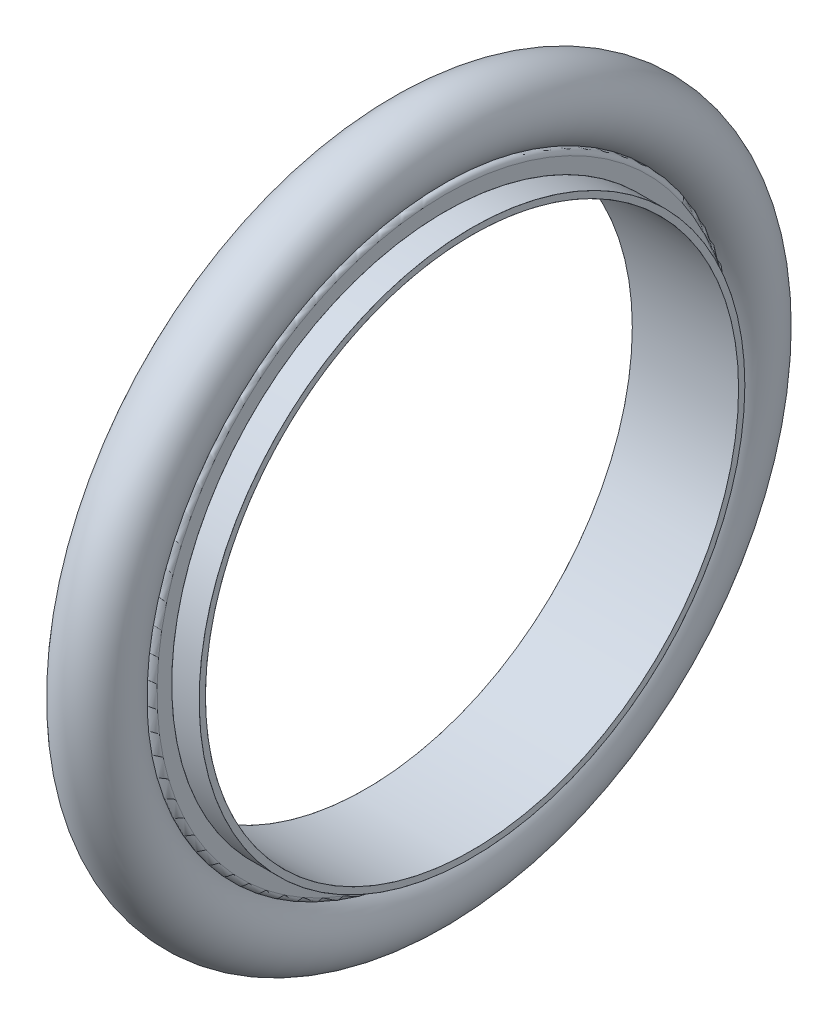
ISO-10303-21;
HEADER;
FILE_DESCRIPTION(('STEP AP214'),'2;1');
FILE_NAME('part.step','',(''),(''),'','','');
FILE_SCHEMA(('AUTOMOTIVE_DESIGN { 1 0 10303 214 1 1 1 1 }'));
ENDSEC;
DATA;
#1=APPLICATION_CONTEXT('core data for automotive mechanical design processes');
#2=APPLICATION_PROTOCOL_DEFINITION('international standard','automotive_design',2000,#1);
#3=PRODUCT_CONTEXT('',#1,'mechanical');
#4=PRODUCT('Part','Part','',(#3));
#5=PRODUCT_RELATED_PRODUCT_CATEGORY('part','',(#4));
#6=PRODUCT_DEFINITION_FORMATION('','',#4);
#7=PRODUCT_DEFINITION_CONTEXT('part definition',#1,'design');
#8=PRODUCT_DEFINITION('design','',#6,#7);
#9=PRODUCT_DEFINITION_SHAPE('','',#8);
#10=(LENGTH_UNIT() NAMED_UNIT(*) SI_UNIT(.MILLI.,.METRE.));
#11=(NAMED_UNIT(*) PLANE_ANGLE_UNIT() SI_UNIT($,.RADIAN.));
#12=(NAMED_UNIT(*) SI_UNIT($,.STERADIAN.) SOLID_ANGLE_UNIT());
#13=UNCERTAINTY_MEASURE_WITH_UNIT(LENGTH_MEASURE(1.E-05),#10,'distance_accuracy_value','');
#14=(GEOMETRIC_REPRESENTATION_CONTEXT(3) GLOBAL_UNCERTAINTY_ASSIGNED_CONTEXT((#13)) GLOBAL_UNIT_ASSIGNED_CONTEXT((#10,
#11,#12)) REPRESENTATION_CONTEXT('',''));
#15=CARTESIAN_POINT('',(0.,0.,0.));
#16=DIRECTION('',(0.,0.,1.));
#17=DIRECTION('',(1.,0.,0.));
#18=AXIS2_PLACEMENT_3D('',#15,#16,#17);
#19=CARTESIAN_POINT('',(-3.16217300000008,0.,0.));
#20=DIRECTION('',(1.,0.,0.));
#21=DIRECTION('',(0.,0.,-1.));
#22=AXIS2_PLACEMENT_3D('',#19,#20,#21);
#23=CYLINDRICAL_SURFACE('',#22,20.0025);
#24=CARTESIAN_POINT('',(-3.98754600000008,0.,0.));
#25=DIRECTION('',(1.,0.,0.));
#26=DIRECTION('',(0.,0.,-1.));
#27=AXIS2_PLACEMENT_3D('',#24,#25,#26);
#28=CIRCLE('',#27,20.0025);
#29=CARTESIAN_POINT('',(-3.98754600000008,0.,-20.0025));
#30=VERTEX_POINT('',#29);
#31=EDGE_CURVE('E241',#30,#30,#28,.T.);
#32=ORIENTED_EDGE('',*,*,#31,.F.);
#33=EDGE_LOOP('',(#32));
#34=FACE_BOUND('',#33,.T.);
#35=CARTESIAN_POINT('',(3.98754599999992,0.,0.));
#36=DIRECTION('',(1.,0.,0.));
#37=DIRECTION('',(0.,0.,-1.));
#38=AXIS2_PLACEMENT_3D('',#35,#36,#37);
#39=CIRCLE('',#38,20.0025);
#40=CARTESIAN_POINT('',(3.98754599999992,0.,-20.0025));
#41=VERTEX_POINT('',#40);
#42=EDGE_CURVE('E237',#41,#41,#39,.F.);
#43=ORIENTED_EDGE('',*,*,#42,.F.);
#44=EDGE_LOOP('',(#43));
#45=FACE_BOUND('',#44,.T.);
#46=ADVANCED_FACE('F17',(#34,#45),#23,.F.);
#47=CARTESIAN_POINT('',(-3.98754600000008,0.,0.));
#48=DIRECTION('',(1.,0.,0.));
#49=DIRECTION('',(0.,0.,-1.));
#50=AXIS2_PLACEMENT_3D('',#47,#48,#49);
#51=TOROIDAL_SURFACE('',#50,20.002754,0.000254);
#52=ORIENTED_EDGE('',*,*,#31,.T.);
#53=EDGE_LOOP('',(#52));
#54=FACE_BOUND('',#53,.T.);
#55=CARTESIAN_POINT('',(-3.98780000000008,0.,0.));
#56=DIRECTION('',(-1.,0.,0.));
#57=DIRECTION('',(0.,1.,0.));
#58=AXIS2_PLACEMENT_3D('',#55,#56,#57);
#59=CIRCLE('',#58,20.002754);
#60=CARTESIAN_POINT('',(-3.98780000000008,20.002754,0.));
#61=VERTEX_POINT('',#60);
#62=EDGE_CURVE('E240',#61,#61,#59,.F.);
#63=ORIENTED_EDGE('',*,*,#62,.F.);
#64=EDGE_LOOP('',(#63));
#65=FACE_BOUND('',#64,.T.);
#66=ADVANCED_FACE('F260',(#54,#65),#51,.T.);
#67=CARTESIAN_POINT('',(3.98754599999992,0.,0.));
#68=DIRECTION('',(1.,0.,0.));
#69=DIRECTION('',(0.,0.,-1.));
#70=AXIS2_PLACEMENT_3D('',#67,#68,#69);
#71=TOROIDAL_SURFACE('',#70,20.002754,0.000254);
#72=CARTESIAN_POINT('',(3.98779999999992,0.,0.));
#73=DIRECTION('',(1.,0.,0.));
#74=DIRECTION('',(0.,1.,0.));
#75=AXIS2_PLACEMENT_3D('',#72,#73,#74);
#76=CIRCLE('',#75,20.002754);
#77=CARTESIAN_POINT('',(3.98779999999992,20.002754,0.));
#78=VERTEX_POINT('',#77);
#79=EDGE_CURVE('E248',#78,#78,#76,.F.);
#80=ORIENTED_EDGE('',*,*,#79,.F.);
#81=EDGE_LOOP('',(#80));
#82=FACE_BOUND('',#81,.T.);
#83=ORIENTED_EDGE('',*,*,#42,.T.);
#84=EDGE_LOOP('',(#83));
#85=FACE_BOUND('',#84,.T.);
#86=ADVANCED_FACE('F212',(#82,#85),#71,.T.);
#87=CARTESIAN_POINT('',(-3.98780000000008,20.23745,0.));
#88=DIRECTION('',(-1.,0.,0.));
#89=DIRECTION('',(0.,0.,1.));
#90=AXIS2_PLACEMENT_3D('',#87,#88,#89);
#91=PLANE('',#90);
#92=ORIENTED_EDGE('',*,*,#62,.T.);
#93=EDGE_LOOP('',(#92));
#94=FACE_BOUND('',#93,.T.);
#95=CARTESIAN_POINT('',(-3.98780000000008,0.,0.));
#96=DIRECTION('',(1.,0.,0.));
#97=DIRECTION('',(0.,1.,0.));
#98=AXIS2_PLACEMENT_3D('',#95,#96,#97);
#99=CIRCLE('',#98,20.472146);
#100=CARTESIAN_POINT('',(-3.98780000000008,20.472146,0.));
#101=VERTEX_POINT('',#100);
#102=EDGE_CURVE('E195',#101,#101,#99,.T.);
#103=ORIENTED_EDGE('',*,*,#102,.F.);
#104=EDGE_LOOP('',(#103));
#105=FACE_BOUND('',#104,.T.);
#106=ADVANCED_FACE('F202',(#94,#105),#91,.T.);
#107=CARTESIAN_POINT('',(3.98779999999992,20.23745,0.));
#108=DIRECTION('',(1.,0.,0.));
#109=DIRECTION('',(0.,0.,-1.));
#110=AXIS2_PLACEMENT_3D('',#107,#108,#109);
#111=PLANE('',#110);
#112=ORIENTED_EDGE('',*,*,#79,.T.);
#113=EDGE_LOOP('',(#112));
#114=FACE_BOUND('',#113,.T.);
#115=CARTESIAN_POINT('',(3.98779999999992,0.,0.));
#116=DIRECTION('',(-1.,0.,0.));
#117=DIRECTION('',(0.,1.,0.));
#118=AXIS2_PLACEMENT_3D('',#115,#116,#117);
#119=CIRCLE('',#118,20.472146);
#120=CARTESIAN_POINT('',(3.98779999999992,20.472146,0.));
#121=VERTEX_POINT('',#120);
#122=EDGE_CURVE('E162',#121,#121,#119,.T.);
#123=ORIENTED_EDGE('',*,*,#122,.F.);
#124=EDGE_LOOP('',(#123));
#125=FACE_BOUND('',#124,.T.);
#126=ADVANCED_FACE('F211',(#114,#125),#111,.T.);
#127=CARTESIAN_POINT('',(-3.98754600000008,0.,0.));
#128=DIRECTION('',(1.,0.,0.));
#129=DIRECTION('',(0.,0.,-1.));
#130=AXIS2_PLACEMENT_3D('',#127,#128,#129);
#131=TOROIDAL_SURFACE('',#130,20.472146,0.000254);
#132=ORIENTED_EDGE('',*,*,#102,.T.);
#133=EDGE_LOOP('',(#132));
#134=FACE_BOUND('',#133,.T.);
#135=CARTESIAN_POINT('',(-3.98754600000008,0.,0.));
#136=DIRECTION('',(1.,0.,0.));
#137=DIRECTION('',(0.,0.,-1.));
#138=AXIS2_PLACEMENT_3D('',#135,#136,#137);
#139=CIRCLE('',#138,20.4724);
#140=CARTESIAN_POINT('',(-3.98754600000008,0.,-20.4724));
#141=VERTEX_POINT('',#140);
#142=EDGE_CURVE('E157',#141,#141,#139,.T.);
#143=ORIENTED_EDGE('',*,*,#142,.F.);
#144=EDGE_LOOP('',(#143));
#145=FACE_BOUND('',#144,.T.);
#146=ADVANCED_FACE('F175',(#134,#145),#131,.T.);
#147=CARTESIAN_POINT('',(3.98754599999992,0.,0.));
#148=DIRECTION('',(1.,0.,0.));
#149=DIRECTION('',(0.,0.,-1.));
#150=AXIS2_PLACEMENT_3D('',#147,#148,#149);
#151=TOROIDAL_SURFACE('',#150,20.472146,0.000254);
#152=CARTESIAN_POINT('',(3.98754599999992,0.,0.));
#153=DIRECTION('',(1.,0.,0.));
#154=DIRECTION('',(0.,0.,-1.));
#155=AXIS2_PLACEMENT_3D('',#152,#153,#154);
#156=CIRCLE('',#155,20.4724);
#157=CARTESIAN_POINT('',(3.98754599999992,0.,-20.4724));
#158=VERTEX_POINT('',#157);
#159=EDGE_CURVE('E149',#158,#158,#156,.F.);
#160=ORIENTED_EDGE('',*,*,#159,.F.);
#161=EDGE_LOOP('',(#160));
#162=FACE_BOUND('',#161,.T.);
#163=ORIENTED_EDGE('',*,*,#122,.T.);
#164=EDGE_LOOP('',(#163));
#165=FACE_BOUND('',#164,.T.);
#166=ADVANCED_FACE('F170',(#162,#165),#151,.T.);
#167=CARTESIAN_POINT('',(-2.95910000000008,0.,0.));
#168=DIRECTION('',(1.,0.,0.));
#169=DIRECTION('',(0.,0.,-1.));
#170=AXIS2_PLACEMENT_3D('',#167,#168,#169);
#171=CYLINDRICAL_SURFACE('',#170,20.4724);
#172=ORIENTED_EDGE('',*,*,#142,.T.);
#173=EDGE_LOOP('',(#172));
#174=FACE_BOUND('',#173,.T.);
#175=CARTESIAN_POINT('',(-1.93065400000008,0.,0.));
#176=DIRECTION('',(1.,0.,0.));
#177=DIRECTION('',(0.,0.,-1.));
#178=AXIS2_PLACEMENT_3D('',#175,#176,#177);
#179=CIRCLE('',#178,20.4724);
#180=CARTESIAN_POINT('',(-1.93065400000008,0.,-20.4724));
#181=VERTEX_POINT('',#180);
#182=EDGE_CURVE('E117',#181,#181,#179,.F.);
#183=ORIENTED_EDGE('',*,*,#182,.T.);
#184=EDGE_LOOP('',(#183));
#185=FACE_BOUND('',#184,.T.);
#186=ADVANCED_FACE('F174',(#174,#185),#171,.T.);
#187=CARTESIAN_POINT('',(2.95909999999992,0.,0.));
#188=DIRECTION('',(1.,0.,0.));
#189=DIRECTION('',(0.,0.,-1.));
#190=AXIS2_PLACEMENT_3D('',#187,#188,#189);
#191=CYLINDRICAL_SURFACE('',#190,20.4724);
#192=CARTESIAN_POINT('',(1.93065399999992,0.,0.));
#193=DIRECTION('',(1.,0.,0.));
#194=DIRECTION('',(0.,0.,-1.));
#195=AXIS2_PLACEMENT_3D('',#192,#193,#194);
#196=CIRCLE('',#195,20.4724);
#197=CARTESIAN_POINT('',(1.93065399999992,0.,-20.4724));
#198=VERTEX_POINT('',#197);
#199=EDGE_CURVE('E113',#198,#198,#196,.T.);
#200=ORIENTED_EDGE('',*,*,#199,.T.);
#201=EDGE_LOOP('',(#200));
#202=FACE_BOUND('',#201,.T.);
#203=ORIENTED_EDGE('',*,*,#159,.T.);
#204=EDGE_LOOP('',(#203));
#205=FACE_BOUND('',#204,.T.);
#206=ADVANCED_FACE('F140',(#202,#205),#191,.T.);
#207=CARTESIAN_POINT('',(-1.93065400000008,0.,0.));
#208=DIRECTION('',(1.,0.,0.));
#209=DIRECTION('',(0.,0.,-1.));
#210=AXIS2_PLACEMENT_3D('',#207,#208,#209);
#211=TOROIDAL_SURFACE('',#210,20.472654,0.000254);
#212=ORIENTED_EDGE('',*,*,#182,.F.);
#213=EDGE_LOOP('',(#212));
#214=FACE_BOUND('',#213,.T.);
#215=CARTESIAN_POINT('',(-1.93040000000008,0.,0.));
#216=DIRECTION('',(-1.,0.,0.));
#217=DIRECTION('',(0.,1.,0.));
#218=AXIS2_PLACEMENT_3D('',#215,#216,#217);
#219=CIRCLE('',#218,20.472654);
#220=CARTESIAN_POINT('',(-1.93040000000008,20.472654,0.));
#221=VERTEX_POINT('',#220);
#222=EDGE_CURVE('E116',#221,#221,#219,.F.);
#223=ORIENTED_EDGE('',*,*,#222,.F.);
#224=EDGE_LOOP('',(#223));
#225=FACE_BOUND('',#224,.T.);
#226=ADVANCED_FACE('F136',(#214,#225),#211,.F.);
#227=CARTESIAN_POINT('',(1.93065399999992,0.,0.));
#228=DIRECTION('',(1.,0.,0.));
#229=DIRECTION('',(0.,0.,-1.));
#230=AXIS2_PLACEMENT_3D('',#227,#228,#229);
#231=TOROIDAL_SURFACE('',#230,20.472654,0.000254);
#232=CARTESIAN_POINT('',(1.93039999999992,0.,0.));
#233=DIRECTION('',(1.,0.,0.));
#234=DIRECTION('',(0.,1.,0.));
#235=AXIS2_PLACEMENT_3D('',#232,#233,#234);
#236=CIRCLE('',#235,20.472654);
#237=CARTESIAN_POINT('',(1.93039999999992,20.472654,0.));
#238=VERTEX_POINT('',#237);
#239=EDGE_CURVE('E124',#238,#238,#236,.F.);
#240=ORIENTED_EDGE('',*,*,#239,.F.);
#241=EDGE_LOOP('',(#240));
#242=FACE_BOUND('',#241,.T.);
#243=ORIENTED_EDGE('',*,*,#199,.F.);
#244=EDGE_LOOP('',(#243));
#245=FACE_BOUND('',#244,.T.);
#246=ADVANCED_FACE('F87',(#242,#245),#231,.F.);
#247=CARTESIAN_POINT('',(-1.93040000000008,21.0234406098197,0.));
#248=DIRECTION('',(-1.,0.,0.));
#249=DIRECTION('',(0.,0.,1.));
#250=AXIS2_PLACEMENT_3D('',#247,#248,#249);
#251=PLANE('',#250);
#252=ORIENTED_EDGE('',*,*,#222,.T.);
#253=EDGE_LOOP('',(#252));
#254=FACE_BOUND('',#253,.T.);
#255=CARTESIAN_POINT('',(-1.93040000000008,0.,0.));
#256=DIRECTION('',(1.,0.,0.));
#257=DIRECTION('',(0.,1.,0.));
#258=AXIS2_PLACEMENT_3D('',#255,#256,#257);
#259=CIRCLE('',#258,21.5742272196394);
#260=CARTESIAN_POINT('',(-1.93040000000008,21.5742272196394,0.));
#261=VERTEX_POINT('',#260);
#262=EDGE_CURVE('E70',#261,#261,#259,.T.);
#263=ORIENTED_EDGE('',*,*,#262,.F.);
#264=EDGE_LOOP('',(#263));
#265=FACE_BOUND('',#264,.T.);
#266=ADVANCED_FACE('F77',(#254,#265),#251,.T.);
#267=CARTESIAN_POINT('',(1.93039999999992,21.0234406098196,0.));
#268=DIRECTION('',(1.,0.,0.));
#269=DIRECTION('',(0.,0.,-1.));
#270=AXIS2_PLACEMENT_3D('',#267,#268,#269);
#271=PLANE('',#270);
#272=ORIENTED_EDGE('',*,*,#239,.T.);
#273=EDGE_LOOP('',(#272));
#274=FACE_BOUND('',#273,.T.);
#275=CARTESIAN_POINT('',(1.93039999999992,0.,0.));
#276=DIRECTION('',(-1.,0.,0.));
#277=DIRECTION('',(0.,1.,0.));
#278=AXIS2_PLACEMENT_3D('',#275,#276,#277);
#279=CIRCLE('',#278,21.5742272196393);
#280=CARTESIAN_POINT('',(1.93039999999992,21.5742272196393,0.));
#281=VERTEX_POINT('',#280);
#282=EDGE_CURVE('E30',#281,#281,#279,.T.);
#283=ORIENTED_EDGE('',*,*,#282,.F.);
#284=EDGE_LOOP('',(#283));
#285=FACE_BOUND('',#284,.T.);
#286=ADVANCED_FACE('F86',(#274,#285),#271,.T.);
#287=CARTESIAN_POINT('',(-1.54940000000008,0.,0.));
#288=DIRECTION('',(1.,0.,0.));
#289=DIRECTION('',(0.,0.,-1.));
#290=AXIS2_PLACEMENT_3D('',#287,#288,#289);
#291=TOROIDAL_SURFACE('',#290,21.5742272196394,0.381);
#292=CARTESIAN_POINT('',(-1.47879421139551,0.,0.));
#293=DIRECTION('',(1.,0.,0.));
#294=DIRECTION('',(0.,0.,-1.));
#295=AXIS2_PLACEMENT_3D('',#292,#293,#294);
#296=CIRCLE('',#295,21.948627837448);
#297=CARTESIAN_POINT('',(-1.47879421139551,0.,-21.948627837448));
#298=VERTEX_POINT('',#297);
#299=EDGE_CURVE('E25',#298,#298,#296,.T.);
#300=ORIENTED_EDGE('',*,*,#299,.F.);
#301=EDGE_LOOP('',(#300));
#302=FACE_BOUND('',#301,.T.);
#303=ORIENTED_EDGE('',*,*,#262,.T.);
#304=EDGE_LOOP('',(#303));
#305=FACE_BOUND('',#304,.T.);
#306=ADVANCED_FACE('F50',(#302,#305),#291,.T.);
#307=CARTESIAN_POINT('',(1.54939999999992,0.,0.));
#308=DIRECTION('',(1.,0.,0.));
#309=DIRECTION('',(0.,0.,-1.));
#310=AXIS2_PLACEMENT_3D('',#307,#308,#309);
#311=TOROIDAL_SURFACE('',#310,21.5742272196393,0.381);
#312=ORIENTED_EDGE('',*,*,#282,.T.);
#313=EDGE_LOOP('',(#312));
#314=FACE_BOUND('',#313,.T.);
#315=CARTESIAN_POINT('',(1.47879421139535,0.,0.));
#316=DIRECTION('',(1.,0.,0.));
#317=DIRECTION('',(0.,0.,-1.));
#318=AXIS2_PLACEMENT_3D('',#315,#316,#317);
#319=CIRCLE('',#318,21.9486278374479);
#320=CARTESIAN_POINT('',(1.47879421139535,0.,-21.9486278374479));
#321=VERTEX_POINT('',#320);
#322=EDGE_CURVE('E10',#321,#321,#319,.F.);
#323=ORIENTED_EDGE('',*,*,#322,.F.);
#324=EDGE_LOOP('',(#323));
#325=FACE_BOUND('',#324,.T.);
#326=ADVANCED_FACE('F44',(#314,#325),#311,.T.);
#327=CARTESIAN_POINT('',(0.,0.,0.));
#328=DIRECTION('',(1.,0.,0.));
#329=DIRECTION('',(0.,0.,-1.));
#330=AXIS2_PLACEMENT_3D('',#327,#328,#329);
#331=TOROIDAL_SURFACE('',#330,24.1681,2.667);
#332=ORIENTED_EDGE('',*,*,#322,.T.);
#333=EDGE_LOOP('',(#332));
#334=FACE_BOUND('',#333,.T.);
#335=ORIENTED_EDGE('',*,*,#299,.T.);
#336=EDGE_LOOP('',(#335));
#337=FACE_BOUND('',#336,.T.);
#338=ADVANCED_FACE('F49',(#334,#337),#331,.T.);
#339=CLOSED_SHELL('',(#46,#66,#86,#106,#126,#146,#166,#186,#206,#226,#246,#266,#286,#306,#326,#338));
#340=MANIFOLD_SOLID_BREP('B1',#339);
#341=ADVANCED_BREP_SHAPE_REPRESENTATION('',(#18,#340),#14);
#342=SHAPE_DEFINITION_REPRESENTATION(#9,#341);
ENDSEC;
END-ISO-10303-21;
